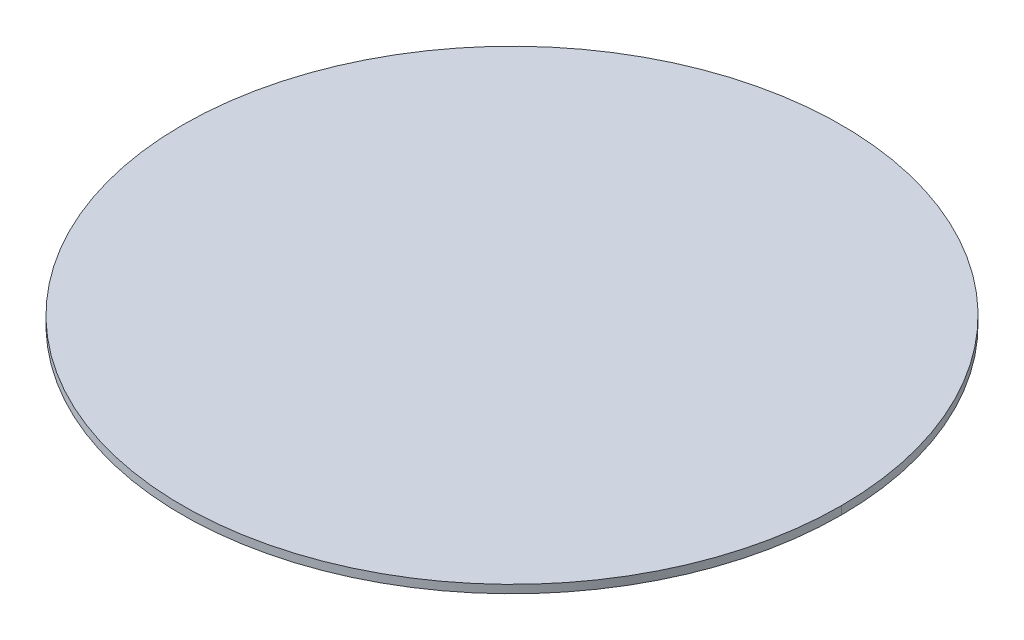
ISO-10303-21;
HEADER;
FILE_DESCRIPTION(('STEP AP214'),'2;1');
FILE_NAME('part.step','',(''),(''),'','','');
FILE_SCHEMA(('AUTOMOTIVE_DESIGN { 1 0 10303 214 1 1 1 1 }'));
ENDSEC;
DATA;
#1=APPLICATION_CONTEXT('core data for automotive mechanical design processes');
#2=APPLICATION_PROTOCOL_DEFINITION('international standard','automotive_design',2000,#1);
#3=PRODUCT_CONTEXT('',#1,'mechanical');
#4=PRODUCT('Part','Part','',(#3));
#5=PRODUCT_RELATED_PRODUCT_CATEGORY('part','',(#4));
#6=PRODUCT_DEFINITION_FORMATION('','',#4);
#7=PRODUCT_DEFINITION_CONTEXT('part definition',#1,'design');
#8=PRODUCT_DEFINITION('design','',#6,#7);
#9=PRODUCT_DEFINITION_SHAPE('','',#8);
#10=(LENGTH_UNIT() NAMED_UNIT(*) SI_UNIT(.MILLI.,.METRE.));
#11=(NAMED_UNIT(*) PLANE_ANGLE_UNIT() SI_UNIT($,.RADIAN.));
#12=(NAMED_UNIT(*) SI_UNIT($,.STERADIAN.) SOLID_ANGLE_UNIT());
#13=UNCERTAINTY_MEASURE_WITH_UNIT(LENGTH_MEASURE(1.E-05),#10,'distance_accuracy_value','');
#14=(GEOMETRIC_REPRESENTATION_CONTEXT(3) GLOBAL_UNCERTAINTY_ASSIGNED_CONTEXT((#13)) GLOBAL_UNIT_ASSIGNED_CONTEXT((#10,
#11,#12)) REPRESENTATION_CONTEXT('',''));
#15=CARTESIAN_POINT('',(0.,0.,0.));
#16=DIRECTION('',(0.,0.,1.));
#17=DIRECTION('',(1.,0.,0.));
#18=AXIS2_PLACEMENT_3D('',#15,#16,#17);
#19=CARTESIAN_POINT('',(0.,0.,0.));
#20=DIRECTION('',(0.,1.,0.));
#21=DIRECTION('',(0.,0.,1.));
#22=AXIS2_PLACEMENT_3D('',#19,#20,#21);
#23=PLANE('',#22);
#24=CARTESIAN_POINT('',(0.,0.,0.));
#25=DIRECTION('',(0.,1.,0.));
#26=DIRECTION('',(1.,0.,0.));
#27=AXIS2_PLACEMENT_3D('',#24,#25,#26);
#28=CIRCLE('',#27,5.1308);
#29=CARTESIAN_POINT('',(5.1308,0.,0.));
#30=VERTEX_POINT('',#29);
#31=CARTESIAN_POINT('',(-5.1308,0.,0.));
#32=VERTEX_POINT('',#31);
#33=EDGE_CURVE('E11',#30,#32,#28,.T.);
#34=ORIENTED_EDGE('',*,*,#33,.F.);
#35=CARTESIAN_POINT('',(0.,0.,0.));
#36=DIRECTION('',(0.,1.,0.));
#37=DIRECTION('',(1.,0.,0.));
#38=AXIS2_PLACEMENT_3D('',#35,#36,#37);
#39=CIRCLE('',#38,5.1308);
#40=EDGE_CURVE('E25',#32,#30,#39,.T.);
#41=ORIENTED_EDGE('',*,*,#40,.F.);
#42=EDGE_LOOP('',(#34,#41));
#43=FACE_BOUND('',#42,.T.);
#44=ADVANCED_FACE('F17',(#43),#23,.F.);
#45=CARTESIAN_POINT('',(0.,0.127,0.));
#46=DIRECTION('',(0.,1.,0.));
#47=DIRECTION('',(0.,0.,-1.));
#48=AXIS2_PLACEMENT_3D('',#45,#46,#47);
#49=CYLINDRICAL_SURFACE('',#48,5.1308);
#50=ORIENTED_EDGE('',*,*,#40,.T.);
#51=DIRECTION('',(0.,1.,0.));
#52=VECTOR('',#51,1.);
#53=CARTESIAN_POINT('',(5.1308,0.,0.));
#54=LINE('',#53,#52);
#55=CARTESIAN_POINT('',(5.1308,0.127,0.));
#56=VERTEX_POINT('',#55);
#57=EDGE_CURVE('E45',#30,#56,#54,.T.);
#58=ORIENTED_EDGE('',*,*,#57,.T.);
#59=CARTESIAN_POINT('',(0.,0.127,0.));
#60=DIRECTION('',(0.,1.,0.));
#61=DIRECTION('',(1.,0.,0.));
#62=AXIS2_PLACEMENT_3D('',#59,#60,#61);
#63=CIRCLE('',#62,5.1308);
#64=CARTESIAN_POINT('',(-5.1308,0.127,0.));
#65=VERTEX_POINT('',#64);
#66=EDGE_CURVE('E40',#65,#56,#63,.T.);
#67=ORIENTED_EDGE('',*,*,#66,.F.);
#68=DIRECTION('',(0.,1.,0.));
#69=VECTOR('',#68,1.);
#70=CARTESIAN_POINT('',(-5.1308,0.,0.));
#71=LINE('',#70,#69);
#72=EDGE_CURVE('E43',#32,#65,#71,.T.);
#73=ORIENTED_EDGE('',*,*,#72,.F.);
#74=EDGE_LOOP('',(#50,#58,#67,#73));
#75=FACE_BOUND('',#74,.T.);
#76=ADVANCED_FACE('F42',(#75),#49,.T.);
#77=CARTESIAN_POINT('',(0.,0.127,0.));
#78=DIRECTION('',(0.,1.,0.));
#79=DIRECTION('',(0.,0.,1.));
#80=AXIS2_PLACEMENT_3D('',#77,#78,#79);
#81=CYLINDRICAL_SURFACE('',#80,5.1308);
#82=CARTESIAN_POINT('',(0.,0.127,0.));
#83=DIRECTION('',(0.,1.,0.));
#84=DIRECTION('',(1.,0.,0.));
#85=AXIS2_PLACEMENT_3D('',#82,#83,#84);
#86=CIRCLE('',#85,5.1308);
#87=EDGE_CURVE('E52',#56,#65,#86,.T.);
#88=ORIENTED_EDGE('',*,*,#87,.F.);
#89=ORIENTED_EDGE('',*,*,#57,.F.);
#90=ORIENTED_EDGE('',*,*,#33,.T.);
#91=ORIENTED_EDGE('',*,*,#72,.T.);
#92=EDGE_LOOP('',(#88,#89,#90,#91));
#93=FACE_BOUND('',#92,.T.);
#94=ADVANCED_FACE('F51',(#93),#81,.T.);
#95=CARTESIAN_POINT('',(0.,0.127,0.));
#96=DIRECTION('',(0.,1.,0.));
#97=DIRECTION('',(0.,0.,1.));
#98=AXIS2_PLACEMENT_3D('',#95,#96,#97);
#99=PLANE('',#98);
#100=ORIENTED_EDGE('',*,*,#87,.T.);
#101=ORIENTED_EDGE('',*,*,#66,.T.);
#102=EDGE_LOOP('',(#100,#101));
#103=FACE_BOUND('',#102,.T.);
#104=ADVANCED_FACE('F54',(#103),#99,.T.);
#105=CLOSED_SHELL('',(#44,#76,#94,#104));
#106=MANIFOLD_SOLID_BREP('B1',#105);
#107=ADVANCED_BREP_SHAPE_REPRESENTATION('',(#18,#106),#14);
#108=SHAPE_DEFINITION_REPRESENTATION(#9,#107);
ENDSEC;
END-ISO-10303-21;
